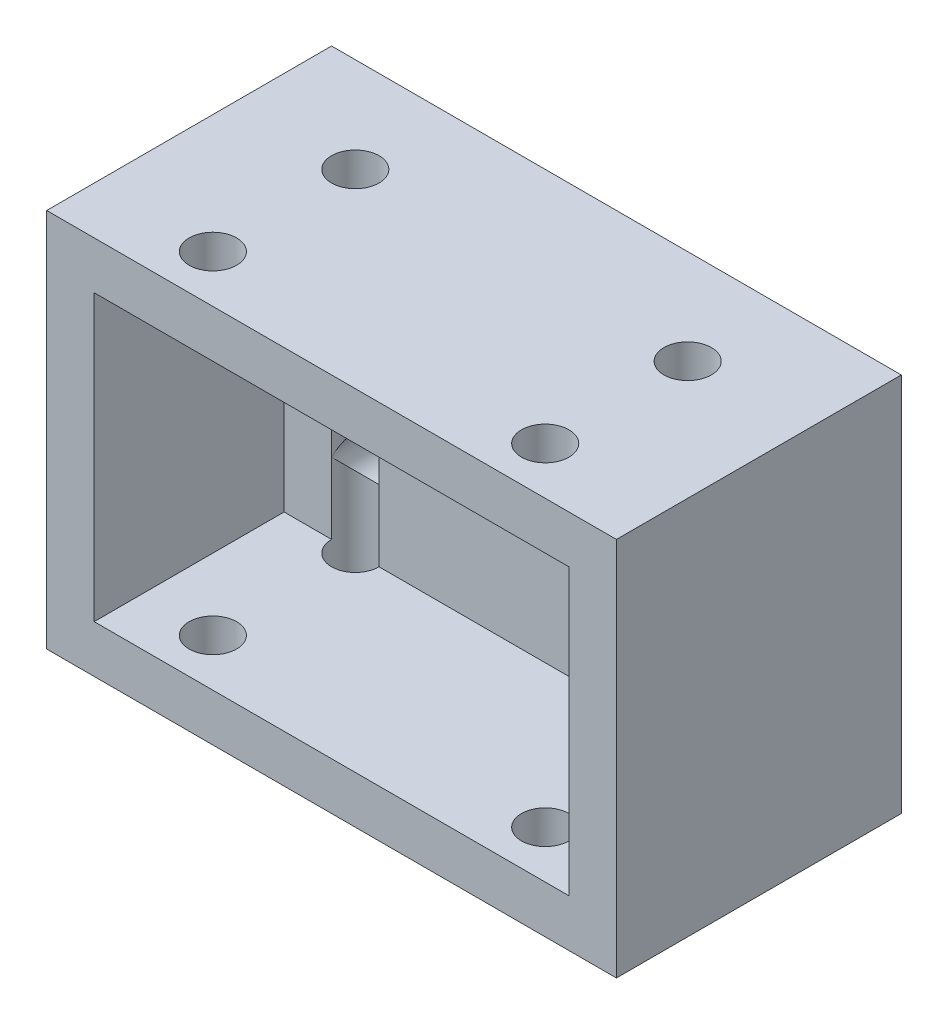
ISO-10303-21;
HEADER;
FILE_DESCRIPTION(('STEP AP214'),'2;1');
FILE_NAME('part.step','',(''),(''),'','','');
FILE_SCHEMA(('AUTOMOTIVE_DESIGN { 1 0 10303 214 1 1 1 1 }'));
ENDSEC;
DATA;
#1=APPLICATION_CONTEXT('core data for automotive mechanical design processes');
#2=APPLICATION_PROTOCOL_DEFINITION('international standard','automotive_design',2000,#1);
#3=PRODUCT_CONTEXT('',#1,'mechanical');
#4=PRODUCT('Part','Part','',(#3));
#5=PRODUCT_RELATED_PRODUCT_CATEGORY('part','',(#4));
#6=PRODUCT_DEFINITION_FORMATION('','',#4);
#7=PRODUCT_DEFINITION_CONTEXT('part definition',#1,'design');
#8=PRODUCT_DEFINITION('design','',#6,#7);
#9=PRODUCT_DEFINITION_SHAPE('','',#8);
#10=(LENGTH_UNIT() NAMED_UNIT(*) SI_UNIT(.MILLI.,.METRE.));
#11=(NAMED_UNIT(*) PLANE_ANGLE_UNIT() SI_UNIT($,.RADIAN.));
#12=(NAMED_UNIT(*) SI_UNIT($,.STERADIAN.) SOLID_ANGLE_UNIT());
#13=UNCERTAINTY_MEASURE_WITH_UNIT(LENGTH_MEASURE(1.E-05),#10,'distance_accuracy_value','');
#14=(GEOMETRIC_REPRESENTATION_CONTEXT(3) GLOBAL_UNCERTAINTY_ASSIGNED_CONTEXT((#13)) GLOBAL_UNIT_ASSIGNED_CONTEXT((#10,
#11,#12)) REPRESENTATION_CONTEXT('',''));
#15=CARTESIAN_POINT('',(0.,0.,0.));
#16=DIRECTION('',(0.,0.,1.));
#17=DIRECTION('',(1.,0.,0.));
#18=AXIS2_PLACEMENT_3D('',#15,#16,#17);
#19=CARTESIAN_POINT('',(0.,0.,10.));
#20=DIRECTION('',(0.,0.,1.));
#21=DIRECTION('',(1.,0.,0.));
#22=AXIS2_PLACEMENT_3D('',#19,#20,#21);
#23=PLANE('',#22);
#24=DIRECTION('',(0.,1.,0.));
#25=VECTOR('',#24,1.);
#26=CARTESIAN_POINT('',(20.,-29.,10.));
#27=LINE('',#26,#25);
#28=CARTESIAN_POINT('',(20.,-15.,10.));
#29=VERTEX_POINT('',#28);
#30=CARTESIAN_POINT('',(20.,-7.49999999999999,10.));
#31=VERTEX_POINT('',#30);
#32=EDGE_CURVE('E11',#29,#31,#27,.T.);
#33=ORIENTED_EDGE('',*,*,#32,.F.);
#34=DIRECTION('',(1.,0.,0.));
#35=VECTOR('',#34,1.);
#36=CARTESIAN_POINT('',(-25.,-15.,10.));
#37=LINE('',#36,#35);
#38=CARTESIAN_POINT('',(25.,-15.,10.));
#39=VERTEX_POINT('',#38);
#40=EDGE_CURVE('E195',#29,#39,#37,.T.);
#41=ORIENTED_EDGE('',*,*,#40,.T.);
#42=DIRECTION('',(0.,1.,0.));
#43=VECTOR('',#42,1.);
#44=CARTESIAN_POINT('',(25.,15.,10.));
#45=LINE('',#44,#43);
#46=CARTESIAN_POINT('',(25.,15.,10.));
#47=VERTEX_POINT('',#46);
#48=EDGE_CURVE('E216',#39,#47,#45,.T.);
#49=ORIENTED_EDGE('',*,*,#48,.T.);
#50=DIRECTION('',(-1.,0.,0.));
#51=VECTOR('',#50,1.);
#52=CARTESIAN_POINT('',(-25.,15.,10.));
#53=LINE('',#52,#51);
#54=CARTESIAN_POINT('',(20.,15.,10.));
#55=VERTEX_POINT('',#54);
#56=EDGE_CURVE('E209',#47,#55,#53,.T.);
#57=ORIENTED_EDGE('',*,*,#56,.T.);
#58=CARTESIAN_POINT('',(20.,7.50000000000001,10.));
#59=VERTEX_POINT('',#58);
#60=EDGE_CURVE('E54',#59,#55,#27,.T.);
#61=ORIENTED_EDGE('',*,*,#60,.F.);
#62=EDGE_CURVE('E52',#31,#59,#27,.T.);
#63=ORIENTED_EDGE('',*,*,#62,.F.);
#64=EDGE_LOOP('',(#33,#41,#49,#57,#61,#63));
#65=FACE_BOUND('',#64,.T.);
#66=ADVANCED_FACE('F42',(#65),#23,.T.);
#67=DIRECTION('',(0.,1.,0.));
#68=VECTOR('',#67,1.);
#69=CARTESIAN_POINT('',(15.,-29.,10.));
#70=LINE('',#69,#68);
#71=CARTESIAN_POINT('',(15.,15.,10.));
#72=VERTEX_POINT('',#71);
#73=CARTESIAN_POINT('',(15.,7.50000000000001,10.));
#74=VERTEX_POINT('',#73);
#75=EDGE_CURVE('E354',#72,#74,#70,.F.);
#76=ORIENTED_EDGE('',*,*,#75,.F.);
#77=CARTESIAN_POINT('',(-15.,15.,10.));
#78=VERTEX_POINT('',#77);
#79=EDGE_CURVE('E212',#72,#78,#53,.T.);
#80=ORIENTED_EDGE('',*,*,#79,.T.);
#81=DIRECTION('',(0.,1.,0.));
#82=VECTOR('',#81,1.);
#83=CARTESIAN_POINT('',(-15.,-29.,10.));
#84=LINE('',#83,#82);
#85=CARTESIAN_POINT('',(-15.,7.50000000000001,10.));
#86=VERTEX_POINT('',#85);
#87=EDGE_CURVE('E348',#86,#78,#84,.T.);
#88=ORIENTED_EDGE('',*,*,#87,.F.);
#89=CARTESIAN_POINT('',(-15.,-7.49999999999999,10.));
#90=VERTEX_POINT('',#89);
#91=EDGE_CURVE('E351',#90,#86,#84,.T.);
#92=ORIENTED_EDGE('',*,*,#91,.F.);
#93=CARTESIAN_POINT('',(-15.,-15.,10.));
#94=VERTEX_POINT('',#93);
#95=EDGE_CURVE('E352',#94,#90,#84,.T.);
#96=ORIENTED_EDGE('',*,*,#95,.F.);
#97=CARTESIAN_POINT('',(15.,-15.,10.));
#98=VERTEX_POINT('',#97);
#99=EDGE_CURVE('E182',#94,#98,#37,.T.);
#100=ORIENTED_EDGE('',*,*,#99,.T.);
#101=CARTESIAN_POINT('',(15.,-7.49999999999999,10.));
#102=VERTEX_POINT('',#101);
#103=EDGE_CURVE('E66',#102,#98,#70,.F.);
#104=ORIENTED_EDGE('',*,*,#103,.F.);
#105=EDGE_CURVE('E61',#74,#102,#70,.F.);
#106=ORIENTED_EDGE('',*,*,#105,.F.);
#107=EDGE_LOOP('',(#76,#80,#88,#92,#96,#100,#104,#106));
#108=FACE_BOUND('',#107,.T.);
#109=ADVANCED_FACE('F383',(#108),#23,.T.);
#110=CARTESIAN_POINT('',(-17.5,7.50000000000001,30.));
#111=DIRECTION('',(0.,0.,-1.));
#112=DIRECTION('',(-1.,0.,0.));
#113=AXIS2_PLACEMENT_3D('',#110,#111,#112);
#114=CYLINDRICAL_SURFACE('',#113,2.5);
#115=CARTESIAN_POINT('',(-17.5,7.50000000000001,9.99999999999999));
#116=DIRECTION('',(0.,0.707106781186547,-0.707106781186547));
#117=DIRECTION('',(0.,-0.707106781186547,-0.707106781186547));
#118=AXIS2_PLACEMENT_3D('',#115,#116,#117);
#119=ELLIPSE('',#118,3.53553390593274,2.5);
#120=CARTESIAN_POINT('',(-20.,7.50000000000001,10.));
#121=VERTEX_POINT('',#120);
#122=EDGE_CURVE('E262',#86,#121,#119,.T.);
#123=ORIENTED_EDGE('',*,*,#122,.F.);
#124=CARTESIAN_POINT('',(-17.5,7.50000000000001,9.99999999999999));
#125=DIRECTION('',(0.,-0.707106781186547,-0.707106781186547));
#126=DIRECTION('',(0.,0.707106781186547,-0.707106781186547));
#127=AXIS2_PLACEMENT_3D('',#124,#125,#126);
#128=ELLIPSE('',#127,3.53553390593274,2.5);
#129=EDGE_CURVE('E266',#121,#86,#128,.T.);
#130=ORIENTED_EDGE('',*,*,#129,.F.);
#131=EDGE_LOOP('',(#123,#130));
#132=FACE_BOUND('',#131,.T.);
#133=CARTESIAN_POINT('',(-17.5,7.50000000000001,0.));
#134=DIRECTION('',(0.,0.,1.));
#135=DIRECTION('',(1.,0.,0.));
#136=AXIS2_PLACEMENT_3D('',#133,#134,#135);
#137=CIRCLE('',#136,2.5);
#138=CARTESIAN_POINT('',(-15.,7.50000000000001,0.));
#139=VERTEX_POINT('',#138);
#140=EDGE_CURVE('E658',#139,#139,#137,.T.);
#141=ORIENTED_EDGE('',*,*,#140,.F.);
#142=EDGE_LOOP('',(#141));
#143=FACE_BOUND('',#142,.T.);
#144=ADVANCED_FACE('F389',(#132,#143),#114,.F.);
#145=CARTESIAN_POINT('',(17.5,7.50000000000001,30.));
#146=DIRECTION('',(0.,0.,-1.));
#147=DIRECTION('',(-1.,0.,0.));
#148=AXIS2_PLACEMENT_3D('',#145,#146,#147);
#149=CYLINDRICAL_SURFACE('',#148,2.5);
#150=CARTESIAN_POINT('',(17.5,7.50000000000001,10.));
#151=DIRECTION('',(0.,0.707106781186547,-0.707106781186547));
#152=DIRECTION('',(0.,-0.707106781186547,-0.707106781186547));
#153=AXIS2_PLACEMENT_3D('',#150,#151,#152);
#154=ELLIPSE('',#153,3.53553390593274,2.5);
#155=EDGE_CURVE('E238',#59,#74,#154,.T.);
#156=ORIENTED_EDGE('',*,*,#155,.F.);
#157=CARTESIAN_POINT('',(17.5,7.50000000000001,10.));
#158=DIRECTION('',(0.,-0.707106781186547,-0.707106781186547));
#159=DIRECTION('',(0.,0.707106781186547,-0.707106781186547));
#160=AXIS2_PLACEMENT_3D('',#157,#158,#159);
#161=ELLIPSE('',#160,3.53553390593274,2.5);
#162=EDGE_CURVE('E242',#74,#59,#161,.T.);
#163=ORIENTED_EDGE('',*,*,#162,.F.);
#164=EDGE_LOOP('',(#156,#163));
#165=FACE_BOUND('',#164,.T.);
#166=CARTESIAN_POINT('',(17.5,7.50000000000001,0.));
#167=DIRECTION('',(0.,0.,1.));
#168=DIRECTION('',(1.,0.,0.));
#169=AXIS2_PLACEMENT_3D('',#166,#167,#168);
#170=CIRCLE('',#169,2.5);
#171=CARTESIAN_POINT('',(20.,7.50000000000001,0.));
#172=VERTEX_POINT('',#171);
#173=EDGE_CURVE('E661',#172,#172,#170,.T.);
#174=ORIENTED_EDGE('',*,*,#173,.F.);
#175=EDGE_LOOP('',(#174));
#176=FACE_BOUND('',#175,.T.);
#177=ADVANCED_FACE('F424',(#165,#176),#149,.F.);
#178=CARTESIAN_POINT('',(-17.5,-7.49999999999999,30.));
#179=DIRECTION('',(0.,0.,-1.));
#180=DIRECTION('',(-1.,0.,0.));
#181=AXIS2_PLACEMENT_3D('',#178,#179,#180);
#182=CYLINDRICAL_SURFACE('',#181,2.5);
#183=CARTESIAN_POINT('',(-17.5,-7.49999999999999,9.99999999999999));
#184=DIRECTION('',(0.,0.707106781186547,-0.707106781186547));
#185=DIRECTION('',(0.,-0.707106781186547,-0.707106781186547));
#186=AXIS2_PLACEMENT_3D('',#183,#184,#185);
#187=ELLIPSE('',#186,3.53553390593274,2.5);
#188=CARTESIAN_POINT('',(-20.,-7.49999999999999,10.));
#189=VERTEX_POINT('',#188);
#190=EDGE_CURVE('E166',#90,#189,#187,.T.);
#191=ORIENTED_EDGE('',*,*,#190,.F.);
#192=CARTESIAN_POINT('',(-17.5,-7.49999999999999,9.99999999999999));
#193=DIRECTION('',(0.,-0.707106781186547,-0.707106781186547));
#194=DIRECTION('',(0.,0.707106781186547,-0.707106781186547));
#195=AXIS2_PLACEMENT_3D('',#192,#193,#194);
#196=ELLIPSE('',#195,3.53553390593274,2.5);
#197=EDGE_CURVE('E184',#189,#90,#196,.T.);
#198=ORIENTED_EDGE('',*,*,#197,.F.);
#199=EDGE_LOOP('',(#191,#198));
#200=FACE_BOUND('',#199,.T.);
#201=CARTESIAN_POINT('',(-17.5,-7.49999999999999,0.));
#202=DIRECTION('',(0.,0.,1.));
#203=DIRECTION('',(1.,0.,0.));
#204=AXIS2_PLACEMENT_3D('',#201,#202,#203);
#205=CIRCLE('',#204,2.5);
#206=CARTESIAN_POINT('',(-15.,-7.49999999999999,0.));
#207=VERTEX_POINT('',#206);
#208=EDGE_CURVE('E677',#207,#207,#205,.T.);
#209=ORIENTED_EDGE('',*,*,#208,.F.);
#210=EDGE_LOOP('',(#209));
#211=FACE_BOUND('',#210,.T.);
#212=ADVANCED_FACE('F420',(#200,#211),#182,.F.);
#213=CARTESIAN_POINT('',(17.5,-7.49999999999999,30.));
#214=DIRECTION('',(0.,0.,-1.));
#215=DIRECTION('',(-1.,0.,0.));
#216=AXIS2_PLACEMENT_3D('',#213,#214,#215);
#217=CYLINDRICAL_SURFACE('',#216,2.5);
#218=CARTESIAN_POINT('',(17.5,-7.49999999999999,10.));
#219=DIRECTION('',(0.,0.707106781186547,-0.707106781186547));
#220=DIRECTION('',(0.,-0.707106781186547,-0.707106781186547));
#221=AXIS2_PLACEMENT_3D('',#218,#219,#220);
#222=ELLIPSE('',#221,3.53553390593274,2.5);
#223=EDGE_CURVE('E249',#31,#102,#222,.T.);
#224=ORIENTED_EDGE('',*,*,#223,.F.);
#225=CARTESIAN_POINT('',(17.5,-7.49999999999999,10.));
#226=DIRECTION('',(0.,-0.707106781186547,-0.707106781186547));
#227=DIRECTION('',(0.,0.707106781186547,-0.707106781186547));
#228=AXIS2_PLACEMENT_3D('',#225,#226,#227);
#229=ELLIPSE('',#228,3.53553390593274,2.5);
#230=EDGE_CURVE('E252',#102,#31,#229,.T.);
#231=ORIENTED_EDGE('',*,*,#230,.F.);
#232=EDGE_LOOP('',(#224,#231));
#233=FACE_BOUND('',#232,.T.);
#234=CARTESIAN_POINT('',(17.5,-7.49999999999999,0.));
#235=DIRECTION('',(0.,0.,1.));
#236=DIRECTION('',(1.,0.,0.));
#237=AXIS2_PLACEMENT_3D('',#234,#235,#236);
#238=CIRCLE('',#237,2.5);
#239=CARTESIAN_POINT('',(20.,-7.49999999999999,0.));
#240=VERTEX_POINT('',#239);
#241=EDGE_CURVE('E681',#240,#240,#238,.T.);
#242=ORIENTED_EDGE('',*,*,#241,.F.);
#243=EDGE_LOOP('',(#242));
#244=FACE_BOUND('',#243,.T.);
#245=ADVANCED_FACE('F416',(#233,#244),#217,.F.);
#246=CARTESIAN_POINT('',(0.,0.,30.));
#247=DIRECTION('',(0.,0.,1.));
#248=DIRECTION('',(1.,0.,0.));
#249=AXIS2_PLACEMENT_3D('',#246,#247,#248);
#250=PLANE('',#249);
#251=DIRECTION('',(0.,1.,0.));
#252=VECTOR('',#251,1.);
#253=CARTESIAN_POINT('',(25.,15.,30.));
#254=LINE('',#253,#252);
#255=CARTESIAN_POINT('',(25.,-15.,30.));
#256=VERTEX_POINT('',#255);
#257=CARTESIAN_POINT('',(25.,15.,30.));
#258=VERTEX_POINT('',#257);
#259=EDGE_CURVE('E224',#256,#258,#254,.T.);
#260=ORIENTED_EDGE('',*,*,#259,.F.);
#261=DIRECTION('',(1.,0.,0.));
#262=VECTOR('',#261,1.);
#263=CARTESIAN_POINT('',(-25.,-15.,30.));
#264=LINE('',#263,#262);
#265=CARTESIAN_POINT('',(-25.,-15.,30.));
#266=VERTEX_POINT('',#265);
#267=EDGE_CURVE('E219',#266,#256,#264,.T.);
#268=ORIENTED_EDGE('',*,*,#267,.F.);
#269=DIRECTION('',(0.,-1.,0.));
#270=VECTOR('',#269,1.);
#271=CARTESIAN_POINT('',(-25.,15.,30.));
#272=LINE('',#271,#270);
#273=CARTESIAN_POINT('',(-25.,15.,30.));
#274=VERTEX_POINT('',#273);
#275=EDGE_CURVE('E696',#274,#266,#272,.T.);
#276=ORIENTED_EDGE('',*,*,#275,.F.);
#277=DIRECTION('',(-1.,0.,0.));
#278=VECTOR('',#277,1.);
#279=CARTESIAN_POINT('',(-25.,15.,30.));
#280=LINE('',#279,#278);
#281=EDGE_CURVE('E700',#258,#274,#280,.T.);
#282=ORIENTED_EDGE('',*,*,#281,.F.);
#283=EDGE_LOOP('',(#260,#268,#276,#282));
#284=FACE_BOUND('',#283,.T.);
#285=DIRECTION('',(0.,1.,0.));
#286=VECTOR('',#285,1.);
#287=CARTESIAN_POINT('',(30.,20.,30.));
#288=LINE('',#287,#286);
#289=CARTESIAN_POINT('',(30.,-20.,30.));
#290=VERTEX_POINT('',#289);
#291=CARTESIAN_POINT('',(30.,20.,30.));
#292=VERTEX_POINT('',#291);
#293=EDGE_CURVE('E335',#290,#292,#288,.T.);
#294=ORIENTED_EDGE('',*,*,#293,.T.);
#295=DIRECTION('',(-1.,0.,0.));
#296=VECTOR('',#295,1.);
#297=CARTESIAN_POINT('',(-30.,20.,30.));
#298=LINE('',#297,#296);
#299=CARTESIAN_POINT('',(-30.,20.,30.));
#300=VERTEX_POINT('',#299);
#301=EDGE_CURVE('E668',#292,#300,#298,.T.);
#302=ORIENTED_EDGE('',*,*,#301,.T.);
#303=DIRECTION('',(0.,-1.,0.));
#304=VECTOR('',#303,1.);
#305=CARTESIAN_POINT('',(-30.,20.,30.));
#306=LINE('',#305,#304);
#307=CARTESIAN_POINT('',(-30.,-20.,30.));
#308=VERTEX_POINT('',#307);
#309=EDGE_CURVE('E324',#300,#308,#306,.T.);
#310=ORIENTED_EDGE('',*,*,#309,.T.);
#311=DIRECTION('',(1.,0.,0.));
#312=VECTOR('',#311,1.);
#313=CARTESIAN_POINT('',(-30.,-20.,30.));
#314=LINE('',#313,#312);
#315=EDGE_CURVE('E343',#308,#290,#314,.T.);
#316=ORIENTED_EDGE('',*,*,#315,.T.);
#317=EDGE_LOOP('',(#294,#302,#310,#316));
#318=FACE_BOUND('',#317,.T.);
#319=ADVANCED_FACE('F419',(#284,#318),#250,.T.);
#320=CARTESIAN_POINT('',(0.,0.,0.));
#321=DIRECTION('',(0.,0.,1.));
#322=DIRECTION('',(1.,0.,0.));
#323=AXIS2_PLACEMENT_3D('',#320,#321,#322);
#324=PLANE('',#323);
#325=DIRECTION('',(0.,1.,0.));
#326=VECTOR('',#325,1.);
#327=CARTESIAN_POINT('',(30.,20.,0.));
#328=LINE('',#327,#326);
#329=CARTESIAN_POINT('',(30.,-20.,0.));
#330=VERTEX_POINT('',#329);
#331=CARTESIAN_POINT('',(30.,20.,0.));
#332=VERTEX_POINT('',#331);
#333=EDGE_CURVE('E319',#330,#332,#328,.T.);
#334=ORIENTED_EDGE('',*,*,#333,.F.);
#335=DIRECTION('',(1.,0.,0.));
#336=VECTOR('',#335,1.);
#337=CARTESIAN_POINT('',(-30.,-20.,0.));
#338=LINE('',#337,#336);
#339=CARTESIAN_POINT('',(-30.,-20.,0.));
#340=VERTEX_POINT('',#339);
#341=EDGE_CURVE('E331',#340,#330,#338,.T.);
#342=ORIENTED_EDGE('',*,*,#341,.F.);
#343=DIRECTION('',(0.,-1.,0.));
#344=VECTOR('',#343,1.);
#345=CARTESIAN_POINT('',(-30.,20.,0.));
#346=LINE('',#345,#344);
#347=CARTESIAN_POINT('',(-30.,20.,0.));
#348=VERTEX_POINT('',#347);
#349=EDGE_CURVE('E318',#348,#340,#346,.T.);
#350=ORIENTED_EDGE('',*,*,#349,.F.);
#351=DIRECTION('',(-1.,0.,0.));
#352=VECTOR('',#351,1.);
#353=CARTESIAN_POINT('',(-30.,20.,0.));
#354=LINE('',#353,#352);
#355=EDGE_CURVE('E308',#332,#348,#354,.T.);
#356=ORIENTED_EDGE('',*,*,#355,.F.);
#357=EDGE_LOOP('',(#334,#342,#350,#356));
#358=FACE_BOUND('',#357,.T.);
#359=ORIENTED_EDGE('',*,*,#140,.T.);
#360=EDGE_LOOP('',(#359));
#361=FACE_BOUND('',#360,.T.);
#362=ORIENTED_EDGE('',*,*,#173,.T.);
#363=EDGE_LOOP('',(#362));
#364=FACE_BOUND('',#363,.T.);
#365=ORIENTED_EDGE('',*,*,#208,.T.);
#366=EDGE_LOOP('',(#365));
#367=FACE_BOUND('',#366,.T.);
#368=ORIENTED_EDGE('',*,*,#241,.T.);
#369=EDGE_LOOP('',(#368));
#370=FACE_BOUND('',#369,.T.);
#371=ADVANCED_FACE('F329',(#358,#361,#364,#367,#370),#324,.F.);
#372=CARTESIAN_POINT('',(30.,20.,30.));
#373=DIRECTION('',(-1.,0.,0.));
#374=DIRECTION('',(0.,-1.,0.));
#375=AXIS2_PLACEMENT_3D('',#372,#373,#374);
#376=PLANE('',#375);
#377=ORIENTED_EDGE('',*,*,#333,.T.);
#378=DIRECTION('',(0.,0.,-1.));
#379=VECTOR('',#378,1.);
#380=CARTESIAN_POINT('',(30.,20.,30.));
#381=LINE('',#380,#379);
#382=EDGE_CURVE('E172',#292,#332,#381,.T.);
#383=ORIENTED_EDGE('',*,*,#382,.F.);
#384=ORIENTED_EDGE('',*,*,#293,.F.);
#385=DIRECTION('',(0.,0.,-1.));
#386=VECTOR('',#385,1.);
#387=CARTESIAN_POINT('',(30.,-20.,30.));
#388=LINE('',#387,#386);
#389=EDGE_CURVE('E339',#290,#330,#388,.T.);
#390=ORIENTED_EDGE('',*,*,#389,.T.);
#391=EDGE_LOOP('',(#377,#383,#384,#390));
#392=FACE_BOUND('',#391,.T.);
#393=ADVANCED_FACE('F44',(#392),#376,.F.);
#394=CARTESIAN_POINT('',(-30.,20.,30.));
#395=DIRECTION('',(0.,-1.,0.));
#396=DIRECTION('',(0.,0.,-1.));
#397=AXIS2_PLACEMENT_3D('',#394,#395,#396);
#398=PLANE('',#397);
#399=CARTESIAN_POINT('',(-17.5,20.,25.));
#400=DIRECTION('',(0.,1.,0.));
#401=DIRECTION('',(0.,0.,1.));
#402=AXIS2_PLACEMENT_3D('',#399,#400,#401);
#403=CIRCLE('',#402,2.5);
#404=CARTESIAN_POINT('',(-17.5,20.,27.5));
#405=VERTEX_POINT('',#404);
#406=EDGE_CURVE('E285',#405,#405,#403,.T.);
#407=ORIENTED_EDGE('',*,*,#406,.F.);
#408=EDGE_LOOP('',(#407));
#409=FACE_BOUND('',#408,.T.);
#410=CARTESIAN_POINT('',(17.5,20.,25.));
#411=DIRECTION('',(0.,1.,0.));
#412=DIRECTION('',(0.,0.,1.));
#413=AXIS2_PLACEMENT_3D('',#410,#411,#412);
#414=CIRCLE('',#413,2.5);
#415=CARTESIAN_POINT('',(17.5,20.,27.5));
#416=VERTEX_POINT('',#415);
#417=EDGE_CURVE('E289',#416,#416,#414,.T.);
#418=ORIENTED_EDGE('',*,*,#417,.F.);
#419=EDGE_LOOP('',(#418));
#420=FACE_BOUND('',#419,.T.);
#421=CARTESIAN_POINT('',(17.5,20.,10.));
#422=DIRECTION('',(0.,1.,0.));
#423=DIRECTION('',(0.,0.,1.));
#424=AXIS2_PLACEMENT_3D('',#421,#422,#423);
#425=CIRCLE('',#424,2.5);
#426=CARTESIAN_POINT('',(17.5,20.,12.5));
#427=VERTEX_POINT('',#426);
#428=EDGE_CURVE('E284',#427,#427,#425,.T.);
#429=ORIENTED_EDGE('',*,*,#428,.F.);
#430=EDGE_LOOP('',(#429));
#431=FACE_BOUND('',#430,.T.);
#432=CARTESIAN_POINT('',(-17.5,20.,9.99999999999999));
#433=DIRECTION('',(0.,1.,0.));
#434=DIRECTION('',(0.,0.,1.));
#435=AXIS2_PLACEMENT_3D('',#432,#433,#434);
#436=CIRCLE('',#435,2.5);
#437=CARTESIAN_POINT('',(-17.5,20.,12.5));
#438=VERTEX_POINT('',#437);
#439=EDGE_CURVE('E280',#438,#438,#436,.T.);
#440=ORIENTED_EDGE('',*,*,#439,.F.);
#441=EDGE_LOOP('',(#440));
#442=FACE_BOUND('',#441,.T.);
#443=ORIENTED_EDGE('',*,*,#355,.T.);
#444=DIRECTION('',(0.,0.,-1.));
#445=VECTOR('',#444,1.);
#446=CARTESIAN_POINT('',(-30.,20.,30.));
#447=LINE('',#446,#445);
#448=EDGE_CURVE('E310',#300,#348,#447,.T.);
#449=ORIENTED_EDGE('',*,*,#448,.F.);
#450=ORIENTED_EDGE('',*,*,#301,.F.);
#451=ORIENTED_EDGE('',*,*,#382,.T.);
#452=EDGE_LOOP('',(#443,#449,#450,#451));
#453=FACE_BOUND('',#452,.T.);
#454=ADVANCED_FACE('F299',(#409,#420,#431,#442,#453),#398,.F.);
#455=CARTESIAN_POINT('',(-30.,20.,30.));
#456=DIRECTION('',(1.,0.,0.));
#457=DIRECTION('',(0.,0.,-1.));
#458=AXIS2_PLACEMENT_3D('',#455,#456,#457);
#459=PLANE('',#458);
#460=ORIENTED_EDGE('',*,*,#349,.T.);
#461=DIRECTION('',(0.,0.,-1.));
#462=VECTOR('',#461,1.);
#463=CARTESIAN_POINT('',(-30.,-20.,30.));
#464=LINE('',#463,#462);
#465=EDGE_CURVE('E326',#308,#340,#464,.T.);
#466=ORIENTED_EDGE('',*,*,#465,.F.);
#467=ORIENTED_EDGE('',*,*,#309,.F.);
#468=ORIENTED_EDGE('',*,*,#448,.T.);
#469=EDGE_LOOP('',(#460,#466,#467,#468));
#470=FACE_BOUND('',#469,.T.);
#471=ADVANCED_FACE('F302',(#470),#459,.F.);
#472=CARTESIAN_POINT('',(-30.,-20.,30.));
#473=DIRECTION('',(0.,1.,0.));
#474=DIRECTION('',(0.,0.,1.));
#475=AXIS2_PLACEMENT_3D('',#472,#473,#474);
#476=PLANE('',#475);
#477=CARTESIAN_POINT('',(-17.5,-20.,25.));
#478=DIRECTION('',(0.,1.,0.));
#479=DIRECTION('',(0.,0.,1.));
#480=AXIS2_PLACEMENT_3D('',#477,#478,#479);
#481=CIRCLE('',#480,2.5);
#482=CARTESIAN_POINT('',(-17.5,-20.,27.5));
#483=VERTEX_POINT('',#482);
#484=EDGE_CURVE('E220',#483,#483,#481,.T.);
#485=ORIENTED_EDGE('',*,*,#484,.T.);
#486=EDGE_LOOP('',(#485));
#487=FACE_BOUND('',#486,.T.);
#488=CARTESIAN_POINT('',(17.5,-20.,25.));
#489=DIRECTION('',(0.,1.,0.));
#490=DIRECTION('',(0.,0.,1.));
#491=AXIS2_PLACEMENT_3D('',#488,#489,#490);
#492=CIRCLE('',#491,2.5);
#493=CARTESIAN_POINT('',(17.5,-20.,27.5));
#494=VERTEX_POINT('',#493);
#495=EDGE_CURVE('E229',#494,#494,#492,.T.);
#496=ORIENTED_EDGE('',*,*,#495,.T.);
#497=EDGE_LOOP('',(#496));
#498=FACE_BOUND('',#497,.T.);
#499=CARTESIAN_POINT('',(17.5,-20.,10.));
#500=DIRECTION('',(0.,1.,0.));
#501=DIRECTION('',(0.,0.,1.));
#502=AXIS2_PLACEMENT_3D('',#499,#500,#501);
#503=CIRCLE('',#502,2.5);
#504=CARTESIAN_POINT('',(17.5,-20.,12.5));
#505=VERTEX_POINT('',#504);
#506=EDGE_CURVE('E245',#505,#505,#503,.T.);
#507=ORIENTED_EDGE('',*,*,#506,.T.);
#508=EDGE_LOOP('',(#507));
#509=FACE_BOUND('',#508,.T.);
#510=CARTESIAN_POINT('',(-17.5,-20.,9.99999999999999));
#511=DIRECTION('',(0.,1.,0.));
#512=DIRECTION('',(0.,0.,1.));
#513=AXIS2_PLACEMENT_3D('',#510,#511,#512);
#514=CIRCLE('',#513,2.5);
#515=CARTESIAN_POINT('',(-17.5,-20.,12.5));
#516=VERTEX_POINT('',#515);
#517=EDGE_CURVE('E269',#516,#516,#514,.T.);
#518=ORIENTED_EDGE('',*,*,#517,.T.);
#519=EDGE_LOOP('',(#518));
#520=FACE_BOUND('',#519,.T.);
#521=ORIENTED_EDGE('',*,*,#341,.T.);
#522=ORIENTED_EDGE('',*,*,#389,.F.);
#523=ORIENTED_EDGE('',*,*,#315,.F.);
#524=ORIENTED_EDGE('',*,*,#465,.T.);
#525=EDGE_LOOP('',(#521,#522,#523,#524));
#526=FACE_BOUND('',#525,.T.);
#527=ADVANCED_FACE('F414',(#487,#498,#509,#520,#526),#476,.F.);
#528=CARTESIAN_POINT('',(25.,15.,10.));
#529=DIRECTION('',(1.,0.,0.));
#530=DIRECTION('',(0.,1.,0.));
#531=AXIS2_PLACEMENT_3D('',#528,#529,#530);
#532=PLANE('',#531);
#533=ORIENTED_EDGE('',*,*,#259,.T.);
#534=DIRECTION('',(0.,0.,1.));
#535=VECTOR('',#534,1.);
#536=CARTESIAN_POINT('',(25.,15.,10.));
#537=LINE('',#536,#535);
#538=EDGE_CURVE('E193',#47,#258,#537,.T.);
#539=ORIENTED_EDGE('',*,*,#538,.F.);
#540=ORIENTED_EDGE('',*,*,#48,.F.);
#541=DIRECTION('',(0.,0.,1.));
#542=VECTOR('',#541,1.);
#543=CARTESIAN_POINT('',(25.,-15.,10.));
#544=LINE('',#543,#542);
#545=EDGE_CURVE('E684',#39,#256,#544,.T.);
#546=ORIENTED_EDGE('',*,*,#545,.T.);
#547=EDGE_LOOP('',(#533,#539,#540,#546));
#548=FACE_BOUND('',#547,.T.);
#549=ADVANCED_FACE('F411',(#548),#532,.F.);
#550=CARTESIAN_POINT('',(-25.,-15.,10.));
#551=DIRECTION('',(0.,-1.,0.));
#552=DIRECTION('',(0.,0.,-1.));
#553=AXIS2_PLACEMENT_3D('',#550,#551,#552);
#554=PLANE('',#553);
#555=CARTESIAN_POINT('',(-17.5,-15.,25.));
#556=DIRECTION('',(0.,-1.,0.));
#557=DIRECTION('',(0.,0.,-1.));
#558=AXIS2_PLACEMENT_3D('',#555,#556,#557);
#559=CIRCLE('',#558,2.5);
#560=CARTESIAN_POINT('',(-17.5,-15.,22.5));
#561=VERTEX_POINT('',#560);
#562=EDGE_CURVE('E225',#561,#561,#559,.T.);
#563=ORIENTED_EDGE('',*,*,#562,.T.);
#564=EDGE_LOOP('',(#563));
#565=FACE_BOUND('',#564,.T.);
#566=CARTESIAN_POINT('',(17.5,-15.,25.));
#567=DIRECTION('',(0.,-1.,0.));
#568=DIRECTION('',(0.,0.,-1.));
#569=AXIS2_PLACEMENT_3D('',#566,#567,#568);
#570=CIRCLE('',#569,2.5);
#571=CARTESIAN_POINT('',(17.5,-15.,22.5));
#572=VERTEX_POINT('',#571);
#573=EDGE_CURVE('E233',#572,#572,#570,.T.);
#574=ORIENTED_EDGE('',*,*,#573,.T.);
#575=EDGE_LOOP('',(#574));
#576=FACE_BOUND('',#575,.T.);
#577=ORIENTED_EDGE('',*,*,#40,.F.);
#578=CARTESIAN_POINT('',(17.5,-15.,10.));
#579=DIRECTION('',(0.,-1.,0.));
#580=DIRECTION('',(0.,0.,-1.));
#581=AXIS2_PLACEMENT_3D('',#578,#579,#580);
#582=CIRCLE('',#581,2.5);
#583=EDGE_CURVE('E255',#29,#98,#582,.T.);
#584=ORIENTED_EDGE('',*,*,#583,.T.);
#585=ORIENTED_EDGE('',*,*,#99,.F.);
#586=CARTESIAN_POINT('',(-17.5,-15.,9.99999999999999));
#587=DIRECTION('',(0.,-1.,0.));
#588=DIRECTION('',(0.,0.,-1.));
#589=AXIS2_PLACEMENT_3D('',#586,#587,#588);
#590=CIRCLE('',#589,2.5);
#591=CARTESIAN_POINT('',(-20.,-15.,10.));
#592=VERTEX_POINT('',#591);
#593=EDGE_CURVE('E163',#94,#592,#590,.T.);
#594=ORIENTED_EDGE('',*,*,#593,.T.);
#595=CARTESIAN_POINT('',(-25.,-15.,10.));
#596=VERTEX_POINT('',#595);
#597=EDGE_CURVE('E180',#596,#592,#37,.T.);
#598=ORIENTED_EDGE('',*,*,#597,.F.);
#599=DIRECTION('',(0.,0.,1.));
#600=VECTOR('',#599,1.);
#601=CARTESIAN_POINT('',(-25.,-15.,10.));
#602=LINE('',#601,#600);
#603=EDGE_CURVE('E688',#596,#266,#602,.T.);
#604=ORIENTED_EDGE('',*,*,#603,.T.);
#605=ORIENTED_EDGE('',*,*,#267,.T.);
#606=ORIENTED_EDGE('',*,*,#545,.F.);
#607=EDGE_LOOP('',(#577,#584,#585,#594,#598,#604,#605,#606));
#608=FACE_BOUND('',#607,.T.);
#609=ADVANCED_FACE('F179',(#565,#576,#608),#554,.F.);
#610=CARTESIAN_POINT('',(-25.,15.,10.));
#611=DIRECTION('',(-1.,0.,0.));
#612=DIRECTION('',(0.,-1.,0.));
#613=AXIS2_PLACEMENT_3D('',#610,#611,#612);
#614=PLANE('',#613);
#615=ORIENTED_EDGE('',*,*,#275,.T.);
#616=ORIENTED_EDGE('',*,*,#603,.F.);
#617=DIRECTION('',(0.,-1.,0.));
#618=VECTOR('',#617,1.);
#619=CARTESIAN_POINT('',(-25.,15.,10.));
#620=LINE('',#619,#618);
#621=CARTESIAN_POINT('',(-25.,15.,10.));
#622=VERTEX_POINT('',#621);
#623=EDGE_CURVE('E191',#622,#596,#620,.T.);
#624=ORIENTED_EDGE('',*,*,#623,.F.);
#625=DIRECTION('',(0.,0.,1.));
#626=VECTOR('',#625,1.);
#627=CARTESIAN_POINT('',(-25.,15.,10.));
#628=LINE('',#627,#626);
#629=EDGE_CURVE('E199',#622,#274,#628,.T.);
#630=ORIENTED_EDGE('',*,*,#629,.T.);
#631=EDGE_LOOP('',(#615,#616,#624,#630));
#632=FACE_BOUND('',#631,.T.);
#633=ADVANCED_FACE('F400',(#632),#614,.F.);
#634=CARTESIAN_POINT('',(-25.,15.,10.));
#635=DIRECTION('',(0.,1.,0.));
#636=DIRECTION('',(0.,0.,1.));
#637=AXIS2_PLACEMENT_3D('',#634,#635,#636);
#638=PLANE('',#637);
#639=CARTESIAN_POINT('',(-17.5,15.,25.));
#640=DIRECTION('',(0.,1.,0.));
#641=DIRECTION('',(0.,0.,1.));
#642=AXIS2_PLACEMENT_3D('',#639,#640,#641);
#643=CIRCLE('',#642,2.5);
#644=CARTESIAN_POINT('',(-17.5,15.,27.5));
#645=VERTEX_POINT('',#644);
#646=EDGE_CURVE('E46',#645,#645,#643,.T.);
#647=ORIENTED_EDGE('',*,*,#646,.T.);
#648=EDGE_LOOP('',(#647));
#649=FACE_BOUND('',#648,.T.);
#650=CARTESIAN_POINT('',(17.5,15.,25.));
#651=DIRECTION('',(0.,1.,0.));
#652=DIRECTION('',(0.,0.,1.));
#653=AXIS2_PLACEMENT_3D('',#650,#651,#652);
#654=CIRCLE('',#653,2.5);
#655=CARTESIAN_POINT('',(17.5,15.,27.5));
#656=VERTEX_POINT('',#655);
#657=EDGE_CURVE('E237',#656,#656,#654,.T.);
#658=ORIENTED_EDGE('',*,*,#657,.T.);
#659=EDGE_LOOP('',(#658));
#660=FACE_BOUND('',#659,.T.);
#661=ORIENTED_EDGE('',*,*,#79,.F.);
#662=CARTESIAN_POINT('',(17.5,15.,10.));
#663=DIRECTION('',(0.,1.,0.));
#664=DIRECTION('',(0.,0.,1.));
#665=AXIS2_PLACEMENT_3D('',#662,#663,#664);
#666=CIRCLE('',#665,2.5);
#667=EDGE_CURVE('E258',#72,#55,#666,.T.);
#668=ORIENTED_EDGE('',*,*,#667,.T.);
#669=ORIENTED_EDGE('',*,*,#56,.F.);
#670=ORIENTED_EDGE('',*,*,#538,.T.);
#671=ORIENTED_EDGE('',*,*,#281,.T.);
#672=ORIENTED_EDGE('',*,*,#629,.F.);
#673=CARTESIAN_POINT('',(-20.,15.,10.));
#674=VERTEX_POINT('',#673);
#675=EDGE_CURVE('E214',#674,#622,#53,.T.);
#676=ORIENTED_EDGE('',*,*,#675,.F.);
#677=CARTESIAN_POINT('',(-17.5,15.,9.99999999999999));
#678=DIRECTION('',(0.,1.,0.));
#679=DIRECTION('',(0.,0.,1.));
#680=AXIS2_PLACEMENT_3D('',#677,#678,#679);
#681=CIRCLE('',#680,2.5);
#682=EDGE_CURVE('E185',#674,#78,#681,.T.);
#683=ORIENTED_EDGE('',*,*,#682,.T.);
#684=EDGE_LOOP('',(#661,#668,#669,#670,#671,#672,#676,#683));
#685=FACE_BOUND('',#684,.T.);
#686=ADVANCED_FACE('F360',(#649,#660,#685),#638,.F.);
#687=DIRECTION('',(0.,1.,0.));
#688=VECTOR('',#687,1.);
#689=CARTESIAN_POINT('',(-20.,-29.,10.));
#690=LINE('',#689,#688);
#691=EDGE_CURVE('E174',#674,#121,#690,.F.);
#692=ORIENTED_EDGE('',*,*,#691,.F.);
#693=ORIENTED_EDGE('',*,*,#675,.T.);
#694=ORIENTED_EDGE('',*,*,#623,.T.);
#695=ORIENTED_EDGE('',*,*,#597,.T.);
#696=EDGE_CURVE('E158',#189,#592,#690,.F.);
#697=ORIENTED_EDGE('',*,*,#696,.F.);
#698=EDGE_CURVE('E171',#121,#189,#690,.F.);
#699=ORIENTED_EDGE('',*,*,#698,.F.);
#700=EDGE_LOOP('',(#692,#693,#694,#695,#697,#699));
#701=FACE_BOUND('',#700,.T.);
#702=ADVANCED_FACE('F189',(#701),#23,.T.);
#703=CARTESIAN_POINT('',(-17.5,-29.,9.99999999999999));
#704=DIRECTION('',(0.,1.,0.));
#705=DIRECTION('',(0.,0.,1.));
#706=AXIS2_PLACEMENT_3D('',#703,#704,#705);
#707=CYLINDRICAL_SURFACE('',#706,2.5);
#708=ORIENTED_EDGE('',*,*,#190,.T.);
#709=ORIENTED_EDGE('',*,*,#696,.T.);
#710=ORIENTED_EDGE('',*,*,#593,.F.);
#711=ORIENTED_EDGE('',*,*,#95,.T.);
#712=EDGE_LOOP('',(#708,#709,#710,#711));
#713=FACE_BOUND('',#712,.T.);
#714=ORIENTED_EDGE('',*,*,#517,.F.);
#715=EDGE_LOOP('',(#714));
#716=FACE_BOUND('',#715,.T.);
#717=ADVANCED_FACE('F160',(#713,#716),#707,.F.);
#718=ORIENTED_EDGE('',*,*,#122,.T.);
#719=ORIENTED_EDGE('',*,*,#698,.T.);
#720=ORIENTED_EDGE('',*,*,#197,.T.);
#721=ORIENTED_EDGE('',*,*,#91,.T.);
#722=EDGE_LOOP('',(#718,#719,#720,#721));
#723=FACE_BOUND('',#722,.T.);
#724=ADVANCED_FACE('F398',(#723),#707,.F.);
#725=ORIENTED_EDGE('',*,*,#129,.T.);
#726=ORIENTED_EDGE('',*,*,#87,.T.);
#727=ORIENTED_EDGE('',*,*,#682,.F.);
#728=ORIENTED_EDGE('',*,*,#691,.T.);
#729=EDGE_LOOP('',(#725,#726,#727,#728));
#730=FACE_BOUND('',#729,.T.);
#731=ORIENTED_EDGE('',*,*,#439,.T.);
#732=EDGE_LOOP('',(#731));
#733=FACE_BOUND('',#732,.T.);
#734=ADVANCED_FACE('F399',(#730,#733),#707,.F.);
#735=CARTESIAN_POINT('',(17.5,-29.,10.));
#736=DIRECTION('',(0.,1.,0.));
#737=DIRECTION('',(0.,0.,1.));
#738=AXIS2_PLACEMENT_3D('',#735,#736,#737);
#739=CYLINDRICAL_SURFACE('',#738,2.5);
#740=ORIENTED_EDGE('',*,*,#223,.T.);
#741=ORIENTED_EDGE('',*,*,#103,.T.);
#742=ORIENTED_EDGE('',*,*,#583,.F.);
#743=ORIENTED_EDGE('',*,*,#32,.T.);
#744=EDGE_LOOP('',(#740,#741,#742,#743));
#745=FACE_BOUND('',#744,.T.);
#746=ORIENTED_EDGE('',*,*,#506,.F.);
#747=EDGE_LOOP('',(#746));
#748=FACE_BOUND('',#747,.T.);
#749=ADVANCED_FACE('F379',(#745,#748),#739,.F.);
#750=ORIENTED_EDGE('',*,*,#155,.T.);
#751=ORIENTED_EDGE('',*,*,#105,.T.);
#752=ORIENTED_EDGE('',*,*,#230,.T.);
#753=ORIENTED_EDGE('',*,*,#62,.T.);
#754=EDGE_LOOP('',(#750,#751,#752,#753));
#755=FACE_BOUND('',#754,.T.);
#756=ADVANCED_FACE('F376',(#755),#739,.F.);
#757=ORIENTED_EDGE('',*,*,#162,.T.);
#758=ORIENTED_EDGE('',*,*,#60,.T.);
#759=ORIENTED_EDGE('',*,*,#667,.F.);
#760=ORIENTED_EDGE('',*,*,#75,.T.);
#761=EDGE_LOOP('',(#757,#758,#759,#760));
#762=FACE_BOUND('',#761,.T.);
#763=ORIENTED_EDGE('',*,*,#428,.T.);
#764=EDGE_LOOP('',(#763));
#765=FACE_BOUND('',#764,.T.);
#766=ADVANCED_FACE('F297',(#762,#765),#739,.F.);
#767=CARTESIAN_POINT('',(17.5,-29.,25.));
#768=DIRECTION('',(0.,1.,0.));
#769=DIRECTION('',(0.,0.,1.));
#770=AXIS2_PLACEMENT_3D('',#767,#768,#769);
#771=CYLINDRICAL_SURFACE('',#770,2.5);
#772=ORIENTED_EDGE('',*,*,#417,.T.);
#773=EDGE_LOOP('',(#772));
#774=FACE_BOUND('',#773,.T.);
#775=ORIENTED_EDGE('',*,*,#657,.F.);
#776=EDGE_LOOP('',(#775));
#777=FACE_BOUND('',#776,.T.);
#778=ADVANCED_FACE('F363',(#774,#777),#771,.F.);
#779=CARTESIAN_POINT('',(-17.5,-29.,25.));
#780=DIRECTION('',(0.,1.,0.));
#781=DIRECTION('',(0.,0.,1.));
#782=AXIS2_PLACEMENT_3D('',#779,#780,#781);
#783=CYLINDRICAL_SURFACE('',#782,2.5);
#784=ORIENTED_EDGE('',*,*,#406,.T.);
#785=EDGE_LOOP('',(#784));
#786=FACE_BOUND('',#785,.T.);
#787=ORIENTED_EDGE('',*,*,#646,.F.);
#788=EDGE_LOOP('',(#787));
#789=FACE_BOUND('',#788,.T.);
#790=ADVANCED_FACE('F365',(#786,#789),#783,.F.);
#791=ORIENTED_EDGE('',*,*,#573,.F.);
#792=EDGE_LOOP('',(#791));
#793=FACE_BOUND('',#792,.T.);
#794=ORIENTED_EDGE('',*,*,#495,.F.);
#795=EDGE_LOOP('',(#794));
#796=FACE_BOUND('',#795,.T.);
#797=ADVANCED_FACE('F368',(#793,#796),#771,.F.);
#798=ORIENTED_EDGE('',*,*,#562,.F.);
#799=EDGE_LOOP('',(#798));
#800=FACE_BOUND('',#799,.T.);
#801=ORIENTED_EDGE('',*,*,#484,.F.);
#802=EDGE_LOOP('',(#801));
#803=FACE_BOUND('',#802,.T.);
#804=ADVANCED_FACE('F375',(#800,#803),#783,.F.);
#805=CLOSED_SHELL('',(#66,#109,#144,#177,#212,#245,#319,#371,#393,#454,#471,#527,#549,#609,#633,
#686,#702,#717,#724,#734,#749,#756,#766,#778,#790,#797,#804));
#806=MANIFOLD_SOLID_BREP('B2',#805);
#807=ADVANCED_BREP_SHAPE_REPRESENTATION('',(#18,#806),#14);
#808=SHAPE_DEFINITION_REPRESENTATION(#9,#807);
ENDSEC;
END-ISO-10303-21;
